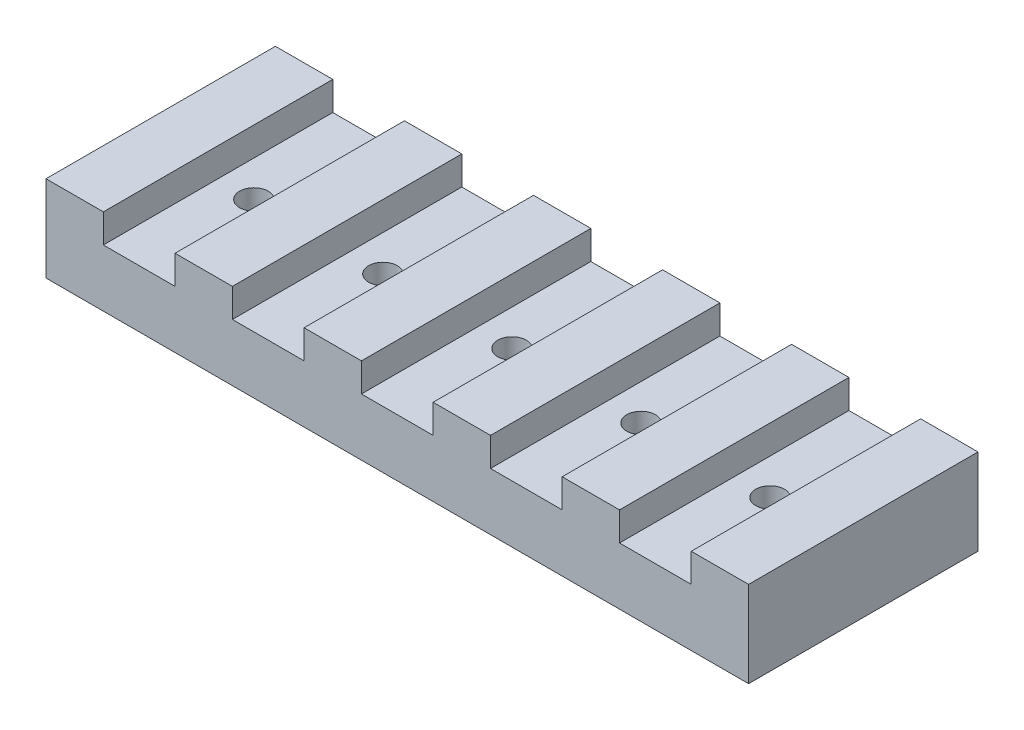
ISO-10303-21;
HEADER;
FILE_DESCRIPTION(('STEP AP214'),'2;1');
FILE_NAME('part.step','',(''),(''),'','','');
FILE_SCHEMA(('AUTOMOTIVE_DESIGN { 1 0 10303 214 1 1 1 1 }'));
ENDSEC;
DATA;
#1=APPLICATION_CONTEXT('core data for automotive mechanical design processes');
#2=APPLICATION_PROTOCOL_DEFINITION('international standard','automotive_design',2000,#1);
#3=PRODUCT_CONTEXT('',#1,'mechanical');
#4=PRODUCT('Part','Part','',(#3));
#5=PRODUCT_RELATED_PRODUCT_CATEGORY('part','',(#4));
#6=PRODUCT_DEFINITION_FORMATION('','',#4);
#7=PRODUCT_DEFINITION_CONTEXT('part definition',#1,'design');
#8=PRODUCT_DEFINITION('design','',#6,#7);
#9=PRODUCT_DEFINITION_SHAPE('','',#8);
#10=(LENGTH_UNIT() NAMED_UNIT(*) SI_UNIT(.MILLI.,.METRE.));
#11=(NAMED_UNIT(*) PLANE_ANGLE_UNIT() SI_UNIT($,.RADIAN.));
#12=(NAMED_UNIT(*) SI_UNIT($,.STERADIAN.) SOLID_ANGLE_UNIT());
#13=UNCERTAINTY_MEASURE_WITH_UNIT(LENGTH_MEASURE(1.E-05),#10,'distance_accuracy_value','');
#14=(GEOMETRIC_REPRESENTATION_CONTEXT(3) GLOBAL_UNCERTAINTY_ASSIGNED_CONTEXT((#13)) GLOBAL_UNIT_ASSIGNED_CONTEXT((#10,
#11,#12)) REPRESENTATION_CONTEXT('',''));
#15=CARTESIAN_POINT('',(0.,0.,0.));
#16=DIRECTION('',(0.,0.,1.));
#17=DIRECTION('',(1.,0.,0.));
#18=AXIS2_PLACEMENT_3D('',#15,#16,#17);
#19=CARTESIAN_POINT('',(0.,-6.35,25.4));
#20=DIRECTION('',(0.,1.,0.));
#21=DIRECTION('',(0.,0.,1.));
#22=AXIS2_PLACEMENT_3D('',#19,#20,#21);
#23=PLANE('',#22);
#24=CARTESIAN_POINT('',(28.575,-6.35,0.));
#25=DIRECTION('',(0.,-1.,0.));
#26=DIRECTION('',(1.,0.,0.));
#27=AXIS2_PLACEMENT_3D('',#24,#25,#26);
#28=CIRCLE('',#27,3.175);
#29=CARTESIAN_POINT('',(31.75,-6.35,0.));
#30=VERTEX_POINT('',#29);
#31=EDGE_CURVE('E470',#30,#30,#28,.T.);
#32=ORIENTED_EDGE('',*,*,#31,.F.);
#33=EDGE_LOOP('',(#32));
#34=FACE_BOUND('',#33,.T.);
#35=CARTESIAN_POINT('',(57.15,-6.35,0.));
#36=DIRECTION('',(0.,-1.,0.));
#37=DIRECTION('',(1.,0.,0.));
#38=AXIS2_PLACEMENT_3D('',#35,#36,#37);
#39=CIRCLE('',#38,3.175);
#40=CARTESIAN_POINT('',(60.325,-6.35,0.));
#41=VERTEX_POINT('',#40);
#42=EDGE_CURVE('E474',#41,#41,#39,.T.);
#43=ORIENTED_EDGE('',*,*,#42,.F.);
#44=EDGE_LOOP('',(#43));
#45=FACE_BOUND('',#44,.T.);
#46=CARTESIAN_POINT('',(0.,-6.35,0.));
#47=DIRECTION('',(0.,1.,0.));
#48=DIRECTION('',(-1.,0.,0.));
#49=AXIS2_PLACEMENT_3D('',#46,#47,#48);
#50=CIRCLE('',#49,3.175);
#51=CARTESIAN_POINT('',(-3.175,-6.35,0.));
#52=VERTEX_POINT('',#51);
#53=EDGE_CURVE('E231',#52,#52,#50,.T.);
#54=ORIENTED_EDGE('',*,*,#53,.T.);
#55=EDGE_LOOP('',(#54));
#56=FACE_BOUND('',#55,.T.);
#57=CARTESIAN_POINT('',(-28.575,-6.35,0.));
#58=DIRECTION('',(0.,1.,0.));
#59=DIRECTION('',(-1.,0.,0.));
#60=AXIS2_PLACEMENT_3D('',#57,#58,#59);
#61=CIRCLE('',#60,3.175);
#62=CARTESIAN_POINT('',(-31.75,-6.35,0.));
#63=VERTEX_POINT('',#62);
#64=EDGE_CURVE('E481',#63,#63,#61,.T.);
#65=ORIENTED_EDGE('',*,*,#64,.T.);
#66=EDGE_LOOP('',(#65));
#67=FACE_BOUND('',#66,.T.);
#68=CARTESIAN_POINT('',(-57.15,-6.35,0.));
#69=DIRECTION('',(0.,1.,0.));
#70=DIRECTION('',(-1.,0.,0.));
#71=AXIS2_PLACEMENT_3D('',#68,#69,#70);
#72=CIRCLE('',#71,3.175);
#73=CARTESIAN_POINT('',(-60.325,-6.35,0.));
#74=VERTEX_POINT('',#73);
#75=EDGE_CURVE('E484',#74,#74,#72,.T.);
#76=ORIENTED_EDGE('',*,*,#75,.T.);
#77=EDGE_LOOP('',(#76));
#78=FACE_BOUND('',#77,.T.);
#79=DIRECTION('',(1.,0.,0.));
#80=VECTOR('',#79,1.);
#81=CARTESIAN_POINT('',(0.,-6.35,-25.4));
#82=LINE('',#81,#80);
#83=CARTESIAN_POINT('',(-77.7875,-6.35,-25.4));
#84=VERTEX_POINT('',#83);
#85=CARTESIAN_POINT('',(77.7875,-6.35,-25.4));
#86=VERTEX_POINT('',#85);
#87=EDGE_CURVE('E228',#84,#86,#82,.T.);
#88=ORIENTED_EDGE('',*,*,#87,.T.);
#89=DIRECTION('',(0.,0.,-1.));
#90=VECTOR('',#89,1.);
#91=CARTESIAN_POINT('',(77.7875,-6.35,25.4));
#92=LINE('',#91,#90);
#93=CARTESIAN_POINT('',(77.7875,-6.35,25.4));
#94=VERTEX_POINT('',#93);
#95=EDGE_CURVE('E11',#94,#86,#92,.T.);
#96=ORIENTED_EDGE('',*,*,#95,.F.);
#97=DIRECTION('',(1.,0.,0.));
#98=VECTOR('',#97,1.);
#99=CARTESIAN_POINT('',(0.,-6.35,25.4));
#100=LINE('',#99,#98);
#101=CARTESIAN_POINT('',(-77.7875,-6.35,25.4));
#102=VERTEX_POINT('',#101);
#103=EDGE_CURVE('E288',#102,#94,#100,.T.);
#104=ORIENTED_EDGE('',*,*,#103,.F.);
#105=DIRECTION('',(0.,0.,-1.));
#106=VECTOR('',#105,1.);
#107=CARTESIAN_POINT('',(-77.7875,-6.35,25.4));
#108=LINE('',#107,#106);
#109=EDGE_CURVE('E51',#102,#84,#108,.T.);
#110=ORIENTED_EDGE('',*,*,#109,.T.);
#111=EDGE_LOOP('',(#88,#96,#104,#110));
#112=FACE_BOUND('',#111,.T.);
#113=ADVANCED_FACE('F35',(#34,#45,#56,#67,#78,#112),#23,.F.);
#114=CARTESIAN_POINT('',(77.7875,0.,25.4));
#115=DIRECTION('',(-1.,0.,0.));
#116=DIRECTION('',(0.,0.,1.));
#117=AXIS2_PLACEMENT_3D('',#114,#115,#116);
#118=PLANE('',#117);
#119=DIRECTION('',(0.,1.,0.));
#120=VECTOR('',#119,1.);
#121=CARTESIAN_POINT('',(77.7875,0.,-25.4));
#122=LINE('',#121,#120);
#123=CARTESIAN_POINT('',(77.7875,12.7,-25.4));
#124=VERTEX_POINT('',#123);
#125=EDGE_CURVE('E230',#86,#124,#122,.T.);
#126=ORIENTED_EDGE('',*,*,#125,.T.);
#127=DIRECTION('',(0.,0.,-1.));
#128=VECTOR('',#127,1.);
#129=CARTESIAN_POINT('',(77.7875,12.7,25.4));
#130=LINE('',#129,#128);
#131=CARTESIAN_POINT('',(77.7875,12.7,25.4));
#132=VERTEX_POINT('',#131);
#133=EDGE_CURVE('E43',#132,#124,#130,.T.);
#134=ORIENTED_EDGE('',*,*,#133,.F.);
#135=DIRECTION('',(0.,1.,0.));
#136=VECTOR('',#135,1.);
#137=CARTESIAN_POINT('',(77.7875,0.,25.4));
#138=LINE('',#137,#136);
#139=EDGE_CURVE('E137',#94,#132,#138,.T.);
#140=ORIENTED_EDGE('',*,*,#139,.F.);
#141=ORIENTED_EDGE('',*,*,#95,.T.);
#142=EDGE_LOOP('',(#126,#134,#140,#141));
#143=FACE_BOUND('',#142,.T.);
#144=ADVANCED_FACE('F462',(#143),#118,.F.);
#145=CARTESIAN_POINT('',(0.,12.7,25.4));
#146=DIRECTION('',(0.,-1.,0.));
#147=DIRECTION('',(1.,0.,0.));
#148=AXIS2_PLACEMENT_3D('',#145,#146,#147);
#149=PLANE('',#148);
#150=DIRECTION('',(-1.,0.,0.));
#151=VECTOR('',#150,1.);
#152=CARTESIAN_POINT('',(0.,12.7,-25.4));
#153=LINE('',#152,#151);
#154=CARTESIAN_POINT('',(65.0875,12.7,-25.4));
#155=VERTEX_POINT('',#154);
#156=EDGE_CURVE('E233',#124,#155,#153,.T.);
#157=ORIENTED_EDGE('',*,*,#156,.T.);
#158=DIRECTION('',(0.,0.,-1.));
#159=VECTOR('',#158,1.);
#160=CARTESIAN_POINT('',(65.0875,12.7,25.4));
#161=LINE('',#160,#159);
#162=CARTESIAN_POINT('',(65.0875,12.7,25.4));
#163=VERTEX_POINT('',#162);
#164=EDGE_CURVE('E326',#163,#155,#161,.T.);
#165=ORIENTED_EDGE('',*,*,#164,.F.);
#166=DIRECTION('',(-1.,0.,0.));
#167=VECTOR('',#166,1.);
#168=CARTESIAN_POINT('',(0.,12.7,25.4));
#169=LINE('',#168,#167);
#170=EDGE_CURVE('E333',#132,#163,#169,.T.);
#171=ORIENTED_EDGE('',*,*,#170,.F.);
#172=ORIENTED_EDGE('',*,*,#133,.T.);
#173=EDGE_LOOP('',(#157,#165,#171,#172));
#174=FACE_BOUND('',#173,.T.);
#175=ADVANCED_FACE('F331',(#174),#149,.F.);
#176=CARTESIAN_POINT('',(65.0875,0.,25.4));
#177=DIRECTION('',(-1.,0.,0.));
#178=DIRECTION('',(0.,0.,1.));
#179=AXIS2_PLACEMENT_3D('',#176,#177,#178);
#180=PLANE('',#179);
#181=DIRECTION('',(0.,1.,0.));
#182=VECTOR('',#181,1.);
#183=CARTESIAN_POINT('',(65.0875,0.,-25.4));
#184=LINE('',#183,#182);
#185=CARTESIAN_POINT('',(65.0875,6.34999999999999,-25.4));
#186=VERTEX_POINT('',#185);
#187=EDGE_CURVE('E236',#186,#155,#184,.T.);
#188=ORIENTED_EDGE('',*,*,#187,.F.);
#189=DIRECTION('',(0.,0.,-1.));
#190=VECTOR('',#189,1.);
#191=CARTESIAN_POINT('',(65.0875,6.34999999999999,25.4));
#192=LINE('',#191,#190);
#193=CARTESIAN_POINT('',(65.0875,6.34999999999999,25.4));
#194=VERTEX_POINT('',#193);
#195=EDGE_CURVE('E324',#194,#186,#192,.T.);
#196=ORIENTED_EDGE('',*,*,#195,.F.);
#197=DIRECTION('',(0.,1.,0.));
#198=VECTOR('',#197,1.);
#199=CARTESIAN_POINT('',(65.0875,0.,25.4));
#200=LINE('',#199,#198);
#201=EDGE_CURVE('E343',#194,#163,#200,.T.);
#202=ORIENTED_EDGE('',*,*,#201,.T.);
#203=ORIENTED_EDGE('',*,*,#164,.T.);
#204=EDGE_LOOP('',(#188,#196,#202,#203));
#205=FACE_BOUND('',#204,.T.);
#206=ADVANCED_FACE('F340',(#205),#180,.T.);
#207=CARTESIAN_POINT('',(0.,6.35,25.4));
#208=DIRECTION('',(0.,1.,0.));
#209=DIRECTION('',(-1.,0.,0.));
#210=AXIS2_PLACEMENT_3D('',#207,#208,#209);
#211=PLANE('',#210);
#212=CARTESIAN_POINT('',(57.15,6.35,0.));
#213=DIRECTION('',(0.,-1.,0.));
#214=DIRECTION('',(1.,0.,0.));
#215=AXIS2_PLACEMENT_3D('',#212,#213,#214);
#216=CIRCLE('',#215,3.175);
#217=CARTESIAN_POINT('',(60.325,6.35,0.));
#218=VERTEX_POINT('',#217);
#219=EDGE_CURVE('E548',#218,#218,#216,.T.);
#220=ORIENTED_EDGE('',*,*,#219,.T.);
#221=EDGE_LOOP('',(#220));
#222=FACE_BOUND('',#221,.T.);
#223=DIRECTION('',(1.,0.,0.));
#224=VECTOR('',#223,1.);
#225=CARTESIAN_POINT('',(0.,6.35,-25.4));
#226=LINE('',#225,#224);
#227=CARTESIAN_POINT('',(49.2125,6.35,-25.4));
#228=VERTEX_POINT('',#227);
#229=EDGE_CURVE('E239',#228,#186,#226,.T.);
#230=ORIENTED_EDGE('',*,*,#229,.F.);
#231=DIRECTION('',(0.,0.,-1.));
#232=VECTOR('',#231,1.);
#233=CARTESIAN_POINT('',(49.2125,6.35,25.4));
#234=LINE('',#233,#232);
#235=CARTESIAN_POINT('',(49.2125,6.35,25.4));
#236=VERTEX_POINT('',#235);
#237=EDGE_CURVE('E322',#236,#228,#234,.T.);
#238=ORIENTED_EDGE('',*,*,#237,.F.);
#239=DIRECTION('',(1.,0.,0.));
#240=VECTOR('',#239,1.);
#241=CARTESIAN_POINT('',(0.,6.35,25.4));
#242=LINE('',#241,#240);
#243=EDGE_CURVE('E346',#236,#194,#242,.T.);
#244=ORIENTED_EDGE('',*,*,#243,.T.);
#245=ORIENTED_EDGE('',*,*,#195,.T.);
#246=EDGE_LOOP('',(#230,#238,#244,#245));
#247=FACE_BOUND('',#246,.T.);
#248=ADVANCED_FACE('F459',(#222,#247),#211,.T.);
#249=CARTESIAN_POINT('',(49.2125,0.,25.4));
#250=DIRECTION('',(-1.,0.,0.));
#251=DIRECTION('',(0.,0.,1.));
#252=AXIS2_PLACEMENT_3D('',#249,#250,#251);
#253=PLANE('',#252);
#254=DIRECTION('',(0.,1.,0.));
#255=VECTOR('',#254,1.);
#256=CARTESIAN_POINT('',(49.2125,0.,-25.4));
#257=LINE('',#256,#255);
#258=CARTESIAN_POINT('',(49.2125,12.7,-25.4));
#259=VERTEX_POINT('',#258);
#260=EDGE_CURVE('E242',#228,#259,#257,.T.);
#261=ORIENTED_EDGE('',*,*,#260,.T.);
#262=DIRECTION('',(0.,0.,-1.));
#263=VECTOR('',#262,1.);
#264=CARTESIAN_POINT('',(49.2125,12.7,25.4));
#265=LINE('',#264,#263);
#266=CARTESIAN_POINT('',(49.2125,12.7,25.4));
#267=VERTEX_POINT('',#266);
#268=EDGE_CURVE('E320',#267,#259,#265,.T.);
#269=ORIENTED_EDGE('',*,*,#268,.F.);
#270=DIRECTION('',(0.,1.,0.));
#271=VECTOR('',#270,1.);
#272=CARTESIAN_POINT('',(49.2125,0.,25.4));
#273=LINE('',#272,#271);
#274=EDGE_CURVE('E348',#236,#267,#273,.T.);
#275=ORIENTED_EDGE('',*,*,#274,.F.);
#276=ORIENTED_EDGE('',*,*,#237,.T.);
#277=EDGE_LOOP('',(#261,#269,#275,#276));
#278=FACE_BOUND('',#277,.T.);
#279=ADVANCED_FACE('F676',(#278),#253,.F.);
#280=CARTESIAN_POINT('',(0.,12.7,25.4));
#281=DIRECTION('',(0.,1.,0.));
#282=DIRECTION('',(-1.,0.,0.));
#283=AXIS2_PLACEMENT_3D('',#280,#281,#282);
#284=PLANE('',#283);
#285=DIRECTION('',(1.,0.,0.));
#286=VECTOR('',#285,1.);
#287=CARTESIAN_POINT('',(0.,12.7,-25.4));
#288=LINE('',#287,#286);
#289=CARTESIAN_POINT('',(36.5125,12.7,-25.4));
#290=VERTEX_POINT('',#289);
#291=EDGE_CURVE('E247',#290,#259,#288,.T.);
#292=ORIENTED_EDGE('',*,*,#291,.F.);
#293=DIRECTION('',(0.,0.,-1.));
#294=VECTOR('',#293,1.);
#295=CARTESIAN_POINT('',(36.5125,12.7,25.4));
#296=LINE('',#295,#294);
#297=CARTESIAN_POINT('',(36.5125,12.7,25.4));
#298=VERTEX_POINT('',#297);
#299=EDGE_CURVE('E318',#298,#290,#296,.T.);
#300=ORIENTED_EDGE('',*,*,#299,.F.);
#301=DIRECTION('',(1.,0.,0.));
#302=VECTOR('',#301,1.);
#303=CARTESIAN_POINT('',(0.,12.7,25.4));
#304=LINE('',#303,#302);
#305=EDGE_CURVE('E355',#298,#267,#304,.T.);
#306=ORIENTED_EDGE('',*,*,#305,.T.);
#307=ORIENTED_EDGE('',*,*,#268,.T.);
#308=EDGE_LOOP('',(#292,#300,#306,#307));
#309=FACE_BOUND('',#308,.T.);
#310=ADVANCED_FACE('F667',(#309),#284,.T.);
#311=CARTESIAN_POINT('',(36.5125,0.,25.4));
#312=DIRECTION('',(-1.,0.,0.));
#313=DIRECTION('',(0.,-1.,0.));
#314=AXIS2_PLACEMENT_3D('',#311,#312,#313);
#315=PLANE('',#314);
#316=DIRECTION('',(0.,1.,0.));
#317=VECTOR('',#316,1.);
#318=CARTESIAN_POINT('',(36.5125,0.,-25.4));
#319=LINE('',#318,#317);
#320=CARTESIAN_POINT('',(36.5125,6.35,-25.4));
#321=VERTEX_POINT('',#320);
#322=EDGE_CURVE('E250',#321,#290,#319,.T.);
#323=ORIENTED_EDGE('',*,*,#322,.F.);
#324=DIRECTION('',(0.,0.,-1.));
#325=VECTOR('',#324,1.);
#326=CARTESIAN_POINT('',(36.5125,6.35,25.4));
#327=LINE('',#326,#325);
#328=CARTESIAN_POINT('',(36.5125,6.35,25.4));
#329=VERTEX_POINT('',#328);
#330=EDGE_CURVE('E316',#329,#321,#327,.T.);
#331=ORIENTED_EDGE('',*,*,#330,.F.);
#332=DIRECTION('',(0.,1.,0.));
#333=VECTOR('',#332,1.);
#334=CARTESIAN_POINT('',(36.5125,0.,25.4));
#335=LINE('',#334,#333);
#336=EDGE_CURVE('E358',#329,#298,#335,.T.);
#337=ORIENTED_EDGE('',*,*,#336,.T.);
#338=ORIENTED_EDGE('',*,*,#299,.T.);
#339=EDGE_LOOP('',(#323,#331,#337,#338));
#340=FACE_BOUND('',#339,.T.);
#341=ADVANCED_FACE('F405',(#340),#315,.T.);
#342=CARTESIAN_POINT('',(28.575,6.35,0.));
#343=DIRECTION('',(0.,-1.,0.));
#344=DIRECTION('',(1.,0.,0.));
#345=AXIS2_PLACEMENT_3D('',#342,#343,#344);
#346=CIRCLE('',#345,3.175);
#347=CARTESIAN_POINT('',(31.75,6.35,0.));
#348=VERTEX_POINT('',#347);
#349=EDGE_CURVE('E541',#348,#348,#346,.T.);
#350=ORIENTED_EDGE('',*,*,#349,.T.);
#351=EDGE_LOOP('',(#350));
#352=FACE_BOUND('',#351,.T.);
#353=CARTESIAN_POINT('',(20.6375,6.35,-25.4));
#354=VERTEX_POINT('',#353);
#355=EDGE_CURVE('E244',#354,#321,#226,.T.);
#356=ORIENTED_EDGE('',*,*,#355,.F.);
#357=DIRECTION('',(0.,0.,-1.));
#358=VECTOR('',#357,1.);
#359=CARTESIAN_POINT('',(20.6375,6.35,25.4));
#360=LINE('',#359,#358);
#361=CARTESIAN_POINT('',(20.6375,6.35,25.4));
#362=VERTEX_POINT('',#361);
#363=EDGE_CURVE('E314',#362,#354,#360,.T.);
#364=ORIENTED_EDGE('',*,*,#363,.F.);
#365=EDGE_CURVE('E350',#362,#329,#242,.T.);
#366=ORIENTED_EDGE('',*,*,#365,.T.);
#367=ORIENTED_EDGE('',*,*,#330,.T.);
#368=EDGE_LOOP('',(#356,#364,#366,#367));
#369=FACE_BOUND('',#368,.T.);
#370=ADVANCED_FACE('F397',(#352,#369),#211,.T.);
#371=CARTESIAN_POINT('',(20.6375,0.,25.4));
#372=DIRECTION('',(-1.,0.,0.));
#373=DIRECTION('',(0.,-1.,0.));
#374=AXIS2_PLACEMENT_3D('',#371,#372,#373);
#375=PLANE('',#374);
#376=DIRECTION('',(0.,1.,0.));
#377=VECTOR('',#376,1.);
#378=CARTESIAN_POINT('',(20.6375,0.,-25.4));
#379=LINE('',#378,#377);
#380=CARTESIAN_POINT('',(20.6375,12.7,-25.4));
#381=VERTEX_POINT('',#380);
#382=EDGE_CURVE('E253',#354,#381,#379,.T.);
#383=ORIENTED_EDGE('',*,*,#382,.T.);
#384=DIRECTION('',(0.,0.,-1.));
#385=VECTOR('',#384,1.);
#386=CARTESIAN_POINT('',(20.6375,12.7,25.4));
#387=LINE('',#386,#385);
#388=CARTESIAN_POINT('',(20.6375,12.7,25.4));
#389=VERTEX_POINT('',#388);
#390=EDGE_CURVE('E312',#389,#381,#387,.T.);
#391=ORIENTED_EDGE('',*,*,#390,.F.);
#392=DIRECTION('',(0.,1.,0.));
#393=VECTOR('',#392,1.);
#394=CARTESIAN_POINT('',(20.6375,0.,25.4));
#395=LINE('',#394,#393);
#396=EDGE_CURVE('E361',#362,#389,#395,.T.);
#397=ORIENTED_EDGE('',*,*,#396,.F.);
#398=ORIENTED_EDGE('',*,*,#363,.T.);
#399=EDGE_LOOP('',(#383,#391,#397,#398));
#400=FACE_BOUND('',#399,.T.);
#401=ADVANCED_FACE('F449',(#400),#375,.F.);
#402=CARTESIAN_POINT('',(0.,12.7,25.4));
#403=DIRECTION('',(0.,1.,0.));
#404=DIRECTION('',(-1.,0.,0.));
#405=AXIS2_PLACEMENT_3D('',#402,#403,#404);
#406=PLANE('',#405);
#407=DIRECTION('',(1.,0.,0.));
#408=VECTOR('',#407,1.);
#409=CARTESIAN_POINT('',(0.,12.7,-25.4));
#410=LINE('',#409,#408);
#411=CARTESIAN_POINT('',(7.93749999999999,12.7,-25.4));
#412=VERTEX_POINT('',#411);
#413=EDGE_CURVE('E256',#412,#381,#410,.T.);
#414=ORIENTED_EDGE('',*,*,#413,.F.);
#415=DIRECTION('',(0.,0.,-1.));
#416=VECTOR('',#415,1.);
#417=CARTESIAN_POINT('',(7.93749999999999,12.7,25.4));
#418=LINE('',#417,#416);
#419=CARTESIAN_POINT('',(7.93749999999999,12.7,25.4));
#420=VERTEX_POINT('',#419);
#421=EDGE_CURVE('E310',#420,#412,#418,.T.);
#422=ORIENTED_EDGE('',*,*,#421,.F.);
#423=DIRECTION('',(1.,0.,0.));
#424=VECTOR('',#423,1.);
#425=CARTESIAN_POINT('',(0.,12.7,25.4));
#426=LINE('',#425,#424);
#427=EDGE_CURVE('E363',#420,#389,#426,.T.);
#428=ORIENTED_EDGE('',*,*,#427,.T.);
#429=ORIENTED_EDGE('',*,*,#390,.T.);
#430=EDGE_LOOP('',(#414,#422,#428,#429));
#431=FACE_BOUND('',#430,.T.);
#432=ADVANCED_FACE('F447',(#431),#406,.T.);
#433=CARTESIAN_POINT('',(7.93749999999999,0.,25.4));
#434=DIRECTION('',(-1.,0.,0.));
#435=DIRECTION('',(0.,0.,1.));
#436=AXIS2_PLACEMENT_3D('',#433,#434,#435);
#437=PLANE('',#436);
#438=DIRECTION('',(0.,1.,0.));
#439=VECTOR('',#438,1.);
#440=CARTESIAN_POINT('',(7.93749999999999,0.,-25.4));
#441=LINE('',#440,#439);
#442=CARTESIAN_POINT('',(7.93749999999999,6.35,-25.4));
#443=VERTEX_POINT('',#442);
#444=EDGE_CURVE('E259',#443,#412,#441,.T.);
#445=ORIENTED_EDGE('',*,*,#444,.F.);
#446=DIRECTION('',(0.,0.,-1.));
#447=VECTOR('',#446,1.);
#448=CARTESIAN_POINT('',(7.93749999999999,6.35,25.4));
#449=LINE('',#448,#447);
#450=CARTESIAN_POINT('',(7.93749999999999,6.35,25.4));
#451=VERTEX_POINT('',#450);
#452=EDGE_CURVE('E308',#451,#443,#449,.T.);
#453=ORIENTED_EDGE('',*,*,#452,.F.);
#454=DIRECTION('',(0.,1.,0.));
#455=VECTOR('',#454,1.);
#456=CARTESIAN_POINT('',(7.93749999999999,0.,25.4));
#457=LINE('',#456,#455);
#458=EDGE_CURVE('E366',#451,#420,#457,.T.);
#459=ORIENTED_EDGE('',*,*,#458,.T.);
#460=ORIENTED_EDGE('',*,*,#421,.T.);
#461=EDGE_LOOP('',(#445,#453,#459,#460));
#462=FACE_BOUND('',#461,.T.);
#463=ADVANCED_FACE('F444',(#462),#437,.T.);
#464=CARTESIAN_POINT('',(0.,6.35,0.));
#465=DIRECTION('',(0.,1.,0.));
#466=DIRECTION('',(-1.,0.,0.));
#467=AXIS2_PLACEMENT_3D('',#464,#465,#466);
#468=CIRCLE('',#467,3.175);
#469=CARTESIAN_POINT('',(-3.175,6.35,0.));
#470=VERTEX_POINT('',#469);
#471=EDGE_CURVE('E531',#470,#470,#468,.T.);
#472=ORIENTED_EDGE('',*,*,#471,.F.);
#473=EDGE_LOOP('',(#472));
#474=FACE_BOUND('',#473,.T.);
#475=CARTESIAN_POINT('',(-7.93750000000001,6.35,-25.4));
#476=VERTEX_POINT('',#475);
#477=EDGE_CURVE('E262',#476,#443,#226,.T.);
#478=ORIENTED_EDGE('',*,*,#477,.F.);
#479=DIRECTION('',(0.,0.,-1.));
#480=VECTOR('',#479,1.);
#481=CARTESIAN_POINT('',(-7.93750000000001,6.35,25.4));
#482=LINE('',#481,#480);
#483=CARTESIAN_POINT('',(-7.93750000000001,6.35,25.4));
#484=VERTEX_POINT('',#483);
#485=EDGE_CURVE('E306',#484,#476,#482,.T.);
#486=ORIENTED_EDGE('',*,*,#485,.F.);
#487=EDGE_CURVE('E369',#484,#451,#242,.T.);
#488=ORIENTED_EDGE('',*,*,#487,.T.);
#489=ORIENTED_EDGE('',*,*,#452,.T.);
#490=EDGE_LOOP('',(#478,#486,#488,#489));
#491=FACE_BOUND('',#490,.T.);
#492=ADVANCED_FACE('F440',(#474,#491),#211,.T.);
#493=CARTESIAN_POINT('',(-7.93750000000001,0.,25.4));
#494=DIRECTION('',(-1.,0.,0.));
#495=DIRECTION('',(0.,0.,1.));
#496=AXIS2_PLACEMENT_3D('',#493,#494,#495);
#497=PLANE('',#496);
#498=DIRECTION('',(0.,1.,0.));
#499=VECTOR('',#498,1.);
#500=CARTESIAN_POINT('',(-7.93750000000001,0.,-25.4));
#501=LINE('',#500,#499);
#502=CARTESIAN_POINT('',(-7.93750000000001,12.7,-25.4));
#503=VERTEX_POINT('',#502);
#504=EDGE_CURVE('E263',#476,#503,#501,.T.);
#505=ORIENTED_EDGE('',*,*,#504,.T.);
#506=DIRECTION('',(0.,0.,-1.));
#507=VECTOR('',#506,1.);
#508=CARTESIAN_POINT('',(-7.93750000000001,12.7,25.4));
#509=LINE('',#508,#507);
#510=CARTESIAN_POINT('',(-7.93750000000001,12.7,25.4));
#511=VERTEX_POINT('',#510);
#512=EDGE_CURVE('E304',#511,#503,#509,.T.);
#513=ORIENTED_EDGE('',*,*,#512,.F.);
#514=DIRECTION('',(0.,1.,0.));
#515=VECTOR('',#514,1.);
#516=CARTESIAN_POINT('',(-7.93750000000001,0.,25.4));
#517=LINE('',#516,#515);
#518=EDGE_CURVE('E370',#484,#511,#517,.T.);
#519=ORIENTED_EDGE('',*,*,#518,.F.);
#520=ORIENTED_EDGE('',*,*,#485,.T.);
#521=EDGE_LOOP('',(#505,#513,#519,#520));
#522=FACE_BOUND('',#521,.T.);
#523=ADVANCED_FACE('F439',(#522),#497,.F.);
#524=CARTESIAN_POINT('',(0.,12.7,25.4));
#525=DIRECTION('',(0.,1.,0.));
#526=DIRECTION('',(-1.,0.,0.));
#527=AXIS2_PLACEMENT_3D('',#524,#525,#526);
#528=PLANE('',#527);
#529=DIRECTION('',(1.,0.,0.));
#530=VECTOR('',#529,1.);
#531=CARTESIAN_POINT('',(0.,12.7,-25.4));
#532=LINE('',#531,#530);
#533=CARTESIAN_POINT('',(-20.6375,12.7,-25.4));
#534=VERTEX_POINT('',#533);
#535=EDGE_CURVE('E266',#534,#503,#532,.T.);
#536=ORIENTED_EDGE('',*,*,#535,.F.);
#537=DIRECTION('',(0.,0.,-1.));
#538=VECTOR('',#537,1.);
#539=CARTESIAN_POINT('',(-20.6375,12.7,25.4));
#540=LINE('',#539,#538);
#541=CARTESIAN_POINT('',(-20.6375,12.7,25.4));
#542=VERTEX_POINT('',#541);
#543=EDGE_CURVE('E302',#542,#534,#540,.T.);
#544=ORIENTED_EDGE('',*,*,#543,.F.);
#545=DIRECTION('',(1.,0.,0.));
#546=VECTOR('',#545,1.);
#547=CARTESIAN_POINT('',(0.,12.7,25.4));
#548=LINE('',#547,#546);
#549=EDGE_CURVE('E372',#542,#511,#548,.T.);
#550=ORIENTED_EDGE('',*,*,#549,.T.);
#551=ORIENTED_EDGE('',*,*,#512,.T.);
#552=EDGE_LOOP('',(#536,#544,#550,#551));
#553=FACE_BOUND('',#552,.T.);
#554=ADVANCED_FACE('F434',(#553),#528,.T.);
#555=CARTESIAN_POINT('',(-20.6375,0.,25.4));
#556=DIRECTION('',(-1.,0.,0.));
#557=DIRECTION('',(0.,0.,1.));
#558=AXIS2_PLACEMENT_3D('',#555,#556,#557);
#559=PLANE('',#558);
#560=DIRECTION('',(0.,1.,0.));
#561=VECTOR('',#560,1.);
#562=CARTESIAN_POINT('',(-20.6375,0.,-25.4));
#563=LINE('',#562,#561);
#564=CARTESIAN_POINT('',(-20.6375,6.35,-25.4));
#565=VERTEX_POINT('',#564);
#566=EDGE_CURVE('E269',#565,#534,#563,.T.);
#567=ORIENTED_EDGE('',*,*,#566,.F.);
#568=DIRECTION('',(0.,0.,-1.));
#569=VECTOR('',#568,1.);
#570=CARTESIAN_POINT('',(-20.6375,6.35,25.4));
#571=LINE('',#570,#569);
#572=CARTESIAN_POINT('',(-20.6375,6.35,25.4));
#573=VERTEX_POINT('',#572);
#574=EDGE_CURVE('E300',#573,#565,#571,.T.);
#575=ORIENTED_EDGE('',*,*,#574,.F.);
#576=DIRECTION('',(0.,1.,0.));
#577=VECTOR('',#576,1.);
#578=CARTESIAN_POINT('',(-20.6375,0.,25.4));
#579=LINE('',#578,#577);
#580=EDGE_CURVE('E375',#573,#542,#579,.T.);
#581=ORIENTED_EDGE('',*,*,#580,.T.);
#582=ORIENTED_EDGE('',*,*,#543,.T.);
#583=EDGE_LOOP('',(#567,#575,#581,#582));
#584=FACE_BOUND('',#583,.T.);
#585=ADVANCED_FACE('F431',(#584),#559,.T.);
#586=CARTESIAN_POINT('',(-28.575,6.35,0.));
#587=DIRECTION('',(0.,1.,0.));
#588=DIRECTION('',(-1.,0.,0.));
#589=AXIS2_PLACEMENT_3D('',#586,#587,#588);
#590=CIRCLE('',#589,3.175);
#591=CARTESIAN_POINT('',(-31.75,6.35,0.));
#592=VERTEX_POINT('',#591);
#593=EDGE_CURVE('E528',#592,#592,#590,.T.);
#594=ORIENTED_EDGE('',*,*,#593,.F.);
#595=EDGE_LOOP('',(#594));
#596=FACE_BOUND('',#595,.T.);
#597=CARTESIAN_POINT('',(-36.5125,6.35,-25.4));
#598=VERTEX_POINT('',#597);
#599=EDGE_CURVE('E272',#598,#565,#226,.T.);
#600=ORIENTED_EDGE('',*,*,#599,.F.);
#601=DIRECTION('',(0.,0.,-1.));
#602=VECTOR('',#601,1.);
#603=CARTESIAN_POINT('',(-36.5125,6.35,25.4));
#604=LINE('',#603,#602);
#605=CARTESIAN_POINT('',(-36.5125,6.35,25.4));
#606=VERTEX_POINT('',#605);
#607=EDGE_CURVE('E298',#606,#598,#604,.T.);
#608=ORIENTED_EDGE('',*,*,#607,.F.);
#609=EDGE_CURVE('E378',#606,#573,#242,.T.);
#610=ORIENTED_EDGE('',*,*,#609,.T.);
#611=ORIENTED_EDGE('',*,*,#574,.T.);
#612=EDGE_LOOP('',(#600,#608,#610,#611));
#613=FACE_BOUND('',#612,.T.);
#614=ADVANCED_FACE('F426',(#596,#613),#211,.T.);
#615=CARTESIAN_POINT('',(-36.5125,0.,25.4));
#616=DIRECTION('',(-1.,0.,0.));
#617=DIRECTION('',(0.,0.,1.));
#618=AXIS2_PLACEMENT_3D('',#615,#616,#617);
#619=PLANE('',#618);
#620=DIRECTION('',(0.,1.,0.));
#621=VECTOR('',#620,1.);
#622=CARTESIAN_POINT('',(-36.5125,0.,-25.4));
#623=LINE('',#622,#621);
#624=CARTESIAN_POINT('',(-36.5125,12.7,-25.4));
#625=VERTEX_POINT('',#624);
#626=EDGE_CURVE('E273',#598,#625,#623,.T.);
#627=ORIENTED_EDGE('',*,*,#626,.T.);
#628=DIRECTION('',(0.,0.,-1.));
#629=VECTOR('',#628,1.);
#630=CARTESIAN_POINT('',(-36.5125,12.7,25.4));
#631=LINE('',#630,#629);
#632=CARTESIAN_POINT('',(-36.5125,12.7,25.4));
#633=VERTEX_POINT('',#632);
#634=EDGE_CURVE('E296',#633,#625,#631,.T.);
#635=ORIENTED_EDGE('',*,*,#634,.F.);
#636=DIRECTION('',(0.,1.,0.));
#637=VECTOR('',#636,1.);
#638=CARTESIAN_POINT('',(-36.5125,0.,25.4));
#639=LINE('',#638,#637);
#640=EDGE_CURVE('E379',#606,#633,#639,.T.);
#641=ORIENTED_EDGE('',*,*,#640,.F.);
#642=ORIENTED_EDGE('',*,*,#607,.T.);
#643=EDGE_LOOP('',(#627,#635,#641,#642));
#644=FACE_BOUND('',#643,.T.);
#645=ADVANCED_FACE('F505',(#644),#619,.F.);
#646=CARTESIAN_POINT('',(0.,12.7,25.4));
#647=DIRECTION('',(0.,1.,0.));
#648=DIRECTION('',(-1.,0.,0.));
#649=AXIS2_PLACEMENT_3D('',#646,#647,#648);
#650=PLANE('',#649);
#651=DIRECTION('',(1.,0.,0.));
#652=VECTOR('',#651,1.);
#653=CARTESIAN_POINT('',(0.,12.7,-25.4));
#654=LINE('',#653,#652);
#655=CARTESIAN_POINT('',(-49.2125,12.7,-25.4));
#656=VERTEX_POINT('',#655);
#657=EDGE_CURVE('E276',#656,#625,#654,.T.);
#658=ORIENTED_EDGE('',*,*,#657,.F.);
#659=DIRECTION('',(0.,0.,-1.));
#660=VECTOR('',#659,1.);
#661=CARTESIAN_POINT('',(-49.2125,12.7,25.4));
#662=LINE('',#661,#660);
#663=CARTESIAN_POINT('',(-49.2125,12.7,25.4));
#664=VERTEX_POINT('',#663);
#665=EDGE_CURVE('E294',#664,#656,#662,.T.);
#666=ORIENTED_EDGE('',*,*,#665,.F.);
#667=DIRECTION('',(1.,0.,0.));
#668=VECTOR('',#667,1.);
#669=CARTESIAN_POINT('',(0.,12.7,25.4));
#670=LINE('',#669,#668);
#671=EDGE_CURVE('E381',#664,#633,#670,.T.);
#672=ORIENTED_EDGE('',*,*,#671,.T.);
#673=ORIENTED_EDGE('',*,*,#634,.T.);
#674=EDGE_LOOP('',(#658,#666,#672,#673));
#675=FACE_BOUND('',#674,.T.);
#676=ADVANCED_FACE('F423',(#675),#650,.T.);
#677=CARTESIAN_POINT('',(-49.2125,0.,25.4));
#678=DIRECTION('',(-1.,0.,0.));
#679=DIRECTION('',(0.,0.,1.));
#680=AXIS2_PLACEMENT_3D('',#677,#678,#679);
#681=PLANE('',#680);
#682=DIRECTION('',(0.,1.,0.));
#683=VECTOR('',#682,1.);
#684=CARTESIAN_POINT('',(-49.2125,0.,-25.4));
#685=LINE('',#684,#683);
#686=CARTESIAN_POINT('',(-49.2125,6.35,-25.4));
#687=VERTEX_POINT('',#686);
#688=EDGE_CURVE('E279',#687,#656,#685,.T.);
#689=ORIENTED_EDGE('',*,*,#688,.F.);
#690=DIRECTION('',(0.,0.,-1.));
#691=VECTOR('',#690,1.);
#692=CARTESIAN_POINT('',(-49.2125,6.35,25.4));
#693=LINE('',#692,#691);
#694=CARTESIAN_POINT('',(-49.2125,6.35,25.4));
#695=VERTEX_POINT('',#694);
#696=EDGE_CURVE('E292',#695,#687,#693,.T.);
#697=ORIENTED_EDGE('',*,*,#696,.F.);
#698=DIRECTION('',(0.,1.,0.));
#699=VECTOR('',#698,1.);
#700=CARTESIAN_POINT('',(-49.2125,0.,25.4));
#701=LINE('',#700,#699);
#702=EDGE_CURVE('E383',#695,#664,#701,.T.);
#703=ORIENTED_EDGE('',*,*,#702,.T.);
#704=ORIENTED_EDGE('',*,*,#665,.T.);
#705=EDGE_LOOP('',(#689,#697,#703,#704));
#706=FACE_BOUND('',#705,.T.);
#707=ADVANCED_FACE('F419',(#706),#681,.T.);
#708=CARTESIAN_POINT('',(-57.15,6.35,0.));
#709=DIRECTION('',(0.,1.,0.));
#710=DIRECTION('',(-1.,0.,0.));
#711=AXIS2_PLACEMENT_3D('',#708,#709,#710);
#712=CIRCLE('',#711,3.175);
#713=CARTESIAN_POINT('',(-60.325,6.35,0.));
#714=VERTEX_POINT('',#713);
#715=EDGE_CURVE('E533',#714,#714,#712,.T.);
#716=ORIENTED_EDGE('',*,*,#715,.F.);
#717=EDGE_LOOP('',(#716));
#718=FACE_BOUND('',#717,.T.);
#719=CARTESIAN_POINT('',(-65.0875,6.35,-25.4));
#720=VERTEX_POINT('',#719);
#721=EDGE_CURVE('E243',#720,#687,#226,.T.);
#722=ORIENTED_EDGE('',*,*,#721,.F.);
#723=DIRECTION('',(0.,0.,-1.));
#724=VECTOR('',#723,1.);
#725=CARTESIAN_POINT('',(-65.0875,6.35,25.4));
#726=LINE('',#725,#724);
#727=CARTESIAN_POINT('',(-65.0875,6.35,25.4));
#728=VERTEX_POINT('',#727);
#729=EDGE_CURVE('E220',#728,#720,#726,.T.);
#730=ORIENTED_EDGE('',*,*,#729,.F.);
#731=EDGE_CURVE('E210',#728,#695,#242,.T.);
#732=ORIENTED_EDGE('',*,*,#731,.T.);
#733=ORIENTED_EDGE('',*,*,#696,.T.);
#734=EDGE_LOOP('',(#722,#730,#732,#733));
#735=FACE_BOUND('',#734,.T.);
#736=ADVANCED_FACE('F418',(#718,#735),#211,.T.);
#737=CARTESIAN_POINT('',(-65.0875,0.,25.4));
#738=DIRECTION('',(-1.,0.,0.));
#739=DIRECTION('',(0.,0.,1.));
#740=AXIS2_PLACEMENT_3D('',#737,#738,#739);
#741=PLANE('',#740);
#742=DIRECTION('',(0.,1.,0.));
#743=VECTOR('',#742,1.);
#744=CARTESIAN_POINT('',(-65.0875,0.,-25.4));
#745=LINE('',#744,#743);
#746=CARTESIAN_POINT('',(-65.0875,12.7,-25.4));
#747=VERTEX_POINT('',#746);
#748=EDGE_CURVE('E217',#720,#747,#745,.T.);
#749=ORIENTED_EDGE('',*,*,#748,.T.);
#750=DIRECTION('',(0.,0.,-1.));
#751=VECTOR('',#750,1.);
#752=CARTESIAN_POINT('',(-65.0875,12.7,25.4));
#753=LINE('',#752,#751);
#754=CARTESIAN_POINT('',(-65.0875,12.7,25.4));
#755=VERTEX_POINT('',#754);
#756=EDGE_CURVE('E214',#755,#747,#753,.T.);
#757=ORIENTED_EDGE('',*,*,#756,.F.);
#758=DIRECTION('',(0.,1.,0.));
#759=VECTOR('',#758,1.);
#760=CARTESIAN_POINT('',(-65.0875,0.,25.4));
#761=LINE('',#760,#759);
#762=EDGE_CURVE('E202',#728,#755,#761,.T.);
#763=ORIENTED_EDGE('',*,*,#762,.F.);
#764=ORIENTED_EDGE('',*,*,#729,.T.);
#765=EDGE_LOOP('',(#749,#757,#763,#764));
#766=FACE_BOUND('',#765,.T.);
#767=ADVANCED_FACE('F215',(#766),#741,.F.);
#768=CARTESIAN_POINT('',(0.,12.7,25.4));
#769=DIRECTION('',(0.,1.,0.));
#770=DIRECTION('',(-1.,0.,0.));
#771=AXIS2_PLACEMENT_3D('',#768,#769,#770);
#772=PLANE('',#771);
#773=DIRECTION('',(1.,0.,0.));
#774=VECTOR('',#773,1.);
#775=CARTESIAN_POINT('',(0.,12.7,-25.4));
#776=LINE('',#775,#774);
#777=CARTESIAN_POINT('',(-77.7875,12.7,-25.4));
#778=VERTEX_POINT('',#777);
#779=EDGE_CURVE('E283',#778,#747,#776,.T.);
#780=ORIENTED_EDGE('',*,*,#779,.F.);
#781=DIRECTION('',(0.,0.,-1.));
#782=VECTOR('',#781,1.);
#783=CARTESIAN_POINT('',(-77.7875,12.7,25.4));
#784=LINE('',#783,#782);
#785=CARTESIAN_POINT('',(-77.7875,12.7,25.4));
#786=VERTEX_POINT('',#785);
#787=EDGE_CURVE('E125',#786,#778,#784,.T.);
#788=ORIENTED_EDGE('',*,*,#787,.F.);
#789=DIRECTION('',(1.,0.,0.));
#790=VECTOR('',#789,1.);
#791=CARTESIAN_POINT('',(0.,12.7,25.4));
#792=LINE('',#791,#790);
#793=EDGE_CURVE('E207',#786,#755,#792,.T.);
#794=ORIENTED_EDGE('',*,*,#793,.T.);
#795=ORIENTED_EDGE('',*,*,#756,.T.);
#796=EDGE_LOOP('',(#780,#788,#794,#795));
#797=FACE_BOUND('',#796,.T.);
#798=ADVANCED_FACE('F222',(#797),#772,.T.);
#799=CARTESIAN_POINT('',(-77.7875,0.,25.4));
#800=DIRECTION('',(-1.,0.,0.));
#801=DIRECTION('',(0.,0.,1.));
#802=AXIS2_PLACEMENT_3D('',#799,#800,#801);
#803=PLANE('',#802);
#804=DIRECTION('',(0.,1.,0.));
#805=VECTOR('',#804,1.);
#806=CARTESIAN_POINT('',(-77.7875,0.,-25.4));
#807=LINE('',#806,#805);
#808=EDGE_CURVE('E285',#84,#778,#807,.T.);
#809=ORIENTED_EDGE('',*,*,#808,.F.);
#810=ORIENTED_EDGE('',*,*,#109,.F.);
#811=DIRECTION('',(0.,1.,0.));
#812=VECTOR('',#811,1.);
#813=CARTESIAN_POINT('',(-77.7875,0.,25.4));
#814=LINE('',#813,#812);
#815=EDGE_CURVE('E223',#102,#786,#814,.T.);
#816=ORIENTED_EDGE('',*,*,#815,.T.);
#817=ORIENTED_EDGE('',*,*,#787,.T.);
#818=EDGE_LOOP('',(#809,#810,#816,#817));
#819=FACE_BOUND('',#818,.T.);
#820=ADVANCED_FACE('F486',(#819),#803,.T.);
#821=CARTESIAN_POINT('',(0.,0.,25.4));
#822=DIRECTION('',(0.,0.,1.));
#823=DIRECTION('',(1.,0.,0.));
#824=AXIS2_PLACEMENT_3D('',#821,#822,#823);
#825=PLANE('',#824);
#826=ORIENTED_EDGE('',*,*,#103,.T.);
#827=ORIENTED_EDGE('',*,*,#139,.T.);
#828=ORIENTED_EDGE('',*,*,#170,.T.);
#829=ORIENTED_EDGE('',*,*,#201,.F.);
#830=ORIENTED_EDGE('',*,*,#243,.F.);
#831=ORIENTED_EDGE('',*,*,#274,.T.);
#832=ORIENTED_EDGE('',*,*,#305,.F.);
#833=ORIENTED_EDGE('',*,*,#336,.F.);
#834=ORIENTED_EDGE('',*,*,#365,.F.);
#835=ORIENTED_EDGE('',*,*,#396,.T.);
#836=ORIENTED_EDGE('',*,*,#427,.F.);
#837=ORIENTED_EDGE('',*,*,#458,.F.);
#838=ORIENTED_EDGE('',*,*,#487,.F.);
#839=ORIENTED_EDGE('',*,*,#518,.T.);
#840=ORIENTED_EDGE('',*,*,#549,.F.);
#841=ORIENTED_EDGE('',*,*,#580,.F.);
#842=ORIENTED_EDGE('',*,*,#609,.F.);
#843=ORIENTED_EDGE('',*,*,#640,.T.);
#844=ORIENTED_EDGE('',*,*,#671,.F.);
#845=ORIENTED_EDGE('',*,*,#702,.F.);
#846=ORIENTED_EDGE('',*,*,#731,.F.);
#847=ORIENTED_EDGE('',*,*,#762,.T.);
#848=ORIENTED_EDGE('',*,*,#793,.F.);
#849=ORIENTED_EDGE('',*,*,#815,.F.);
#850=EDGE_LOOP('',(#826,#827,#828,#829,#830,#831,#832,#833,#834,#835,#836,#837,#838,#839,#840,
#841,#842,#843,#844,#845,#846,#847,#848,#849));
#851=FACE_BOUND('',#850,.T.);
#852=ADVANCED_FACE('F204',(#851),#825,.T.);
#853=CARTESIAN_POINT('',(0.,0.,-25.4));
#854=DIRECTION('',(0.,0.,1.));
#855=DIRECTION('',(1.,0.,0.));
#856=AXIS2_PLACEMENT_3D('',#853,#854,#855);
#857=PLANE('',#856);
#858=ORIENTED_EDGE('',*,*,#87,.F.);
#859=ORIENTED_EDGE('',*,*,#808,.T.);
#860=ORIENTED_EDGE('',*,*,#779,.T.);
#861=ORIENTED_EDGE('',*,*,#748,.F.);
#862=ORIENTED_EDGE('',*,*,#721,.T.);
#863=ORIENTED_EDGE('',*,*,#688,.T.);
#864=ORIENTED_EDGE('',*,*,#657,.T.);
#865=ORIENTED_EDGE('',*,*,#626,.F.);
#866=ORIENTED_EDGE('',*,*,#599,.T.);
#867=ORIENTED_EDGE('',*,*,#566,.T.);
#868=ORIENTED_EDGE('',*,*,#535,.T.);
#869=ORIENTED_EDGE('',*,*,#504,.F.);
#870=ORIENTED_EDGE('',*,*,#477,.T.);
#871=ORIENTED_EDGE('',*,*,#444,.T.);
#872=ORIENTED_EDGE('',*,*,#413,.T.);
#873=ORIENTED_EDGE('',*,*,#382,.F.);
#874=ORIENTED_EDGE('',*,*,#355,.T.);
#875=ORIENTED_EDGE('',*,*,#322,.T.);
#876=ORIENTED_EDGE('',*,*,#291,.T.);
#877=ORIENTED_EDGE('',*,*,#260,.F.);
#878=ORIENTED_EDGE('',*,*,#229,.T.);
#879=ORIENTED_EDGE('',*,*,#187,.T.);
#880=ORIENTED_EDGE('',*,*,#156,.F.);
#881=ORIENTED_EDGE('',*,*,#125,.F.);
#882=EDGE_LOOP('',(#858,#859,#860,#861,#862,#863,#864,#865,#866,#867,#868,#869,#870,#871,#872,
#873,#874,#875,#876,#877,#878,#879,#880,#881));
#883=FACE_BOUND('',#882,.T.);
#884=ADVANCED_FACE('F335',(#883),#857,.F.);
#885=CARTESIAN_POINT('',(-57.15,-6.35,0.));
#886=DIRECTION('',(0.,1.,0.));
#887=DIRECTION('',(-1.,0.,0.));
#888=AXIS2_PLACEMENT_3D('',#885,#886,#887);
#889=CYLINDRICAL_SURFACE('',#888,3.175);
#890=ORIENTED_EDGE('',*,*,#75,.F.);
#891=EDGE_LOOP('',(#890));
#892=FACE_BOUND('',#891,.T.);
#893=ORIENTED_EDGE('',*,*,#715,.T.);
#894=EDGE_LOOP('',(#893));
#895=FACE_BOUND('',#894,.T.);
#896=ADVANCED_FACE('F565',(#892,#895),#889,.F.);
#897=CARTESIAN_POINT('',(-28.575,-6.35,0.));
#898=DIRECTION('',(0.,1.,0.));
#899=DIRECTION('',(-1.,0.,0.));
#900=AXIS2_PLACEMENT_3D('',#897,#898,#899);
#901=CYLINDRICAL_SURFACE('',#900,3.175);
#902=ORIENTED_EDGE('',*,*,#64,.F.);
#903=EDGE_LOOP('',(#902));
#904=FACE_BOUND('',#903,.T.);
#905=ORIENTED_EDGE('',*,*,#593,.T.);
#906=EDGE_LOOP('',(#905));
#907=FACE_BOUND('',#906,.T.);
#908=ADVANCED_FACE('F556',(#904,#907),#901,.F.);
#909=CARTESIAN_POINT('',(0.,-6.35,0.));
#910=DIRECTION('',(0.,1.,0.));
#911=DIRECTION('',(-1.,0.,0.));
#912=AXIS2_PLACEMENT_3D('',#909,#910,#911);
#913=CYLINDRICAL_SURFACE('',#912,3.175);
#914=ORIENTED_EDGE('',*,*,#53,.F.);
#915=EDGE_LOOP('',(#914));
#916=FACE_BOUND('',#915,.T.);
#917=ORIENTED_EDGE('',*,*,#471,.T.);
#918=EDGE_LOOP('',(#917));
#919=FACE_BOUND('',#918,.T.);
#920=ADVANCED_FACE('F553',(#916,#919),#913,.F.);
#921=CARTESIAN_POINT('',(28.575,-6.35,0.));
#922=DIRECTION('',(0.,1.,0.));
#923=DIRECTION('',(-1.,0.,0.));
#924=AXIS2_PLACEMENT_3D('',#921,#922,#923);
#925=CYLINDRICAL_SURFACE('',#924,3.175);
#926=ORIENTED_EDGE('',*,*,#31,.T.);
#927=EDGE_LOOP('',(#926));
#928=FACE_BOUND('',#927,.T.);
#929=ORIENTED_EDGE('',*,*,#349,.F.);
#930=EDGE_LOOP('',(#929));
#931=FACE_BOUND('',#930,.T.);
#932=ADVANCED_FACE('F555',(#928,#931),#925,.F.);
#933=CARTESIAN_POINT('',(57.15,-6.35,0.));
#934=DIRECTION('',(0.,1.,0.));
#935=DIRECTION('',(-1.,0.,0.));
#936=AXIS2_PLACEMENT_3D('',#933,#934,#935);
#937=CYLINDRICAL_SURFACE('',#936,3.175);
#938=ORIENTED_EDGE('',*,*,#42,.T.);
#939=EDGE_LOOP('',(#938));
#940=FACE_BOUND('',#939,.T.);
#941=ORIENTED_EDGE('',*,*,#219,.F.);
#942=EDGE_LOOP('',(#941));
#943=FACE_BOUND('',#942,.T.);
#944=ADVANCED_FACE('F563',(#940,#943),#937,.F.);
#945=CLOSED_SHELL('',(#113,#144,#175,#206,#248,#279,#310,#341,#370,#401,#432,#463,#492,#523,
#554,#585,#614,#645,#676,#707,#736,#767,#798,#820,#852,#884,#896,#908,#920,#932,#944));
#946=MANIFOLD_SOLID_BREP('B2',#945);
#947=ADVANCED_BREP_SHAPE_REPRESENTATION('',(#18,#946),#14);
#948=SHAPE_DEFINITION_REPRESENTATION(#9,#947);
ENDSEC;
END-ISO-10303-21;
